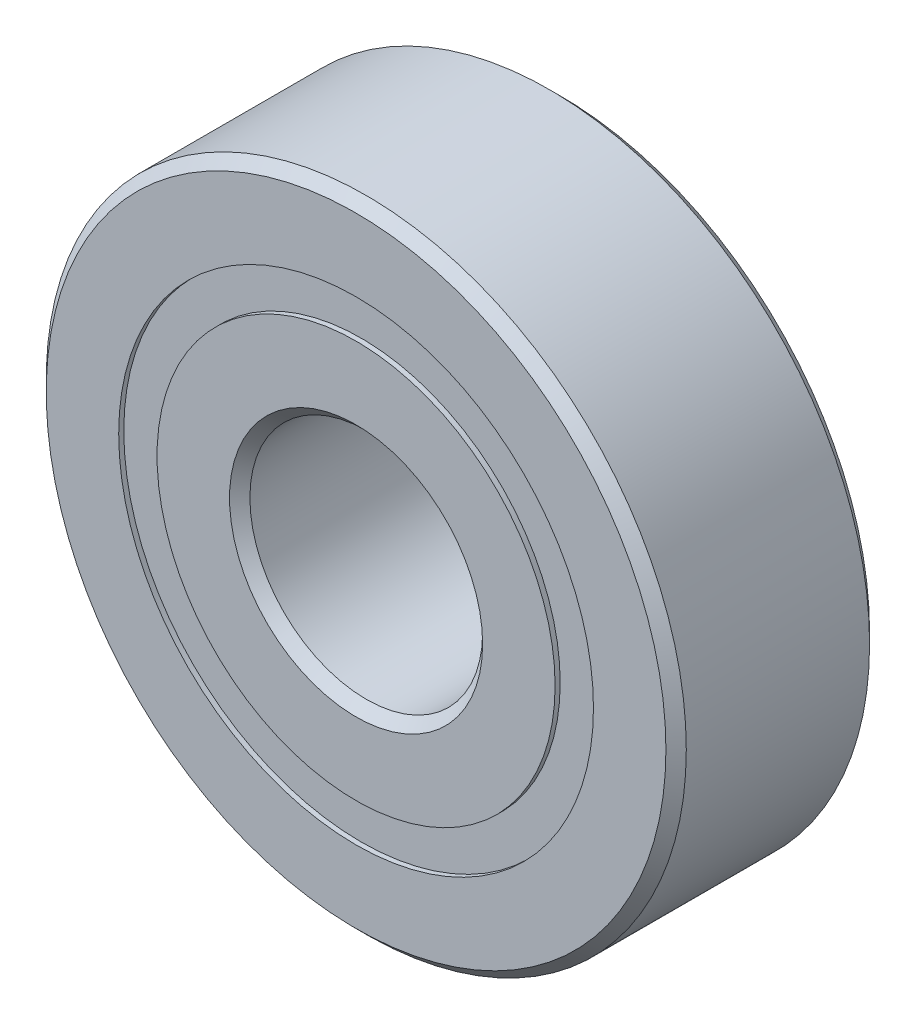
ISO-10303-21;
HEADER;
FILE_DESCRIPTION(('STEP AP214'),'2;1');
FILE_NAME('part.step','',(''),(''),'','','');
FILE_SCHEMA(('AUTOMOTIVE_DESIGN { 1 0 10303 214 1 1 1 1 }'));
ENDSEC;
DATA;
#1=APPLICATION_CONTEXT('core data for automotive mechanical design processes');
#2=APPLICATION_PROTOCOL_DEFINITION('international standard','automotive_design',2000,#1);
#3=PRODUCT_CONTEXT('',#1,'mechanical');
#4=PRODUCT('Part','Part','',(#3));
#5=PRODUCT_RELATED_PRODUCT_CATEGORY('part','',(#4));
#6=PRODUCT_DEFINITION_FORMATION('','',#4);
#7=PRODUCT_DEFINITION_CONTEXT('part definition',#1,'design');
#8=PRODUCT_DEFINITION('design','',#6,#7);
#9=PRODUCT_DEFINITION_SHAPE('','',#8);
#10=(LENGTH_UNIT() NAMED_UNIT(*) SI_UNIT(.MILLI.,.METRE.));
#11=(NAMED_UNIT(*) PLANE_ANGLE_UNIT() SI_UNIT($,.RADIAN.));
#12=(NAMED_UNIT(*) SI_UNIT($,.STERADIAN.) SOLID_ANGLE_UNIT());
#13=UNCERTAINTY_MEASURE_WITH_UNIT(LENGTH_MEASURE(1.E-05),#10,'distance_accuracy_value','');
#14=(GEOMETRIC_REPRESENTATION_CONTEXT(3) GLOBAL_UNCERTAINTY_ASSIGNED_CONTEXT((#13)) GLOBAL_UNIT_ASSIGNED_CONTEXT((#10,
#11,#12)) REPRESENTATION_CONTEXT('',''));
#15=CARTESIAN_POINT('',(0.,0.,0.));
#16=DIRECTION('',(0.,0.,1.));
#17=DIRECTION('',(1.,0.,0.));
#18=AXIS2_PLACEMENT_3D('',#15,#16,#17);
#19=CARTESIAN_POINT('',(0.,8.15934065934066,-3.325));
#20=DIRECTION('',(0.,0.,1.));
#21=DIRECTION('',(1.,0.,0.));
#22=AXIS2_PLACEMENT_3D('',#19,#20,#21);
#23=PLANE('',#22);
#24=CARTESIAN_POINT('',(0.,0.,-3.325));
#25=DIRECTION('',(0.,0.,1.));
#26=DIRECTION('',(1.,0.,0.));
#27=AXIS2_PLACEMENT_3D('',#24,#25,#26);
#28=CIRCLE('',#27,8.15934065934066);
#29=CARTESIAN_POINT('',(8.15934065934066,0.,-3.325));
#30=VERTEX_POINT('',#29);
#31=EDGE_CURVE('E53',#30,#30,#28,.T.);
#32=ORIENTED_EDGE('',*,*,#31,.F.);
#33=EDGE_LOOP('',(#32));
#34=FACE_BOUND('',#33,.T.);
#35=CARTESIAN_POINT('',(0.,0.,-3.325));
#36=DIRECTION('',(0.,0.,1.));
#37=DIRECTION('',(1.,0.,0.));
#38=AXIS2_PLACEMENT_3D('',#35,#36,#37);
#39=CIRCLE('',#38,6.84065934065934);
#40=CARTESIAN_POINT('',(6.84065934065934,0.,-3.325));
#41=VERTEX_POINT('',#40);
#42=EDGE_CURVE('E11',#41,#41,#39,.T.);
#43=ORIENTED_EDGE('',*,*,#42,.T.);
#44=EDGE_LOOP('',(#43));
#45=FACE_BOUND('',#44,.T.);
#46=ADVANCED_FACE('F39',(#34,#45),#23,.F.);
#47=CARTESIAN_POINT('',(0.,0.,3.5));
#48=DIRECTION('',(0.,0.,1.));
#49=DIRECTION('',(1.,0.,0.));
#50=AXIS2_PLACEMENT_3D('',#47,#48,#49);
#51=CYLINDRICAL_SURFACE('',#50,6.84065934065934);
#52=ORIENTED_EDGE('',*,*,#42,.F.);
#53=EDGE_LOOP('',(#52));
#54=FACE_BOUND('',#53,.T.);
#55=CARTESIAN_POINT('',(0.,0.,-1.68952158656808));
#56=DIRECTION('',(0.,0.,1.));
#57=DIRECTION('',(1.,0.,0.));
#58=AXIS2_PLACEMENT_3D('',#55,#56,#57);
#59=CIRCLE('',#58,6.84065934065934);
#60=CARTESIAN_POINT('',(6.84065934065934,0.,-1.68952158656808));
#61=VERTEX_POINT('',#60);
#62=EDGE_CURVE('E45',#61,#61,#59,.T.);
#63=ORIENTED_EDGE('',*,*,#62,.T.);
#64=EDGE_LOOP('',(#63));
#65=FACE_BOUND('',#64,.T.);
#66=ADVANCED_FACE('F62',(#54,#65),#51,.F.);
#67=CARTESIAN_POINT('',(0.,8.15934065934066,-1.68952158656808));
#68=DIRECTION('',(0.,0.,-1.));
#69=DIRECTION('',(-1.,0.,0.));
#70=AXIS2_PLACEMENT_3D('',#67,#68,#69);
#71=PLANE('',#70);
#72=ORIENTED_EDGE('',*,*,#62,.F.);
#73=EDGE_LOOP('',(#72));
#74=FACE_BOUND('',#73,.T.);
#75=CARTESIAN_POINT('',(0.,0.,-1.68952158656808));
#76=DIRECTION('',(0.,0.,1.));
#77=DIRECTION('',(1.,0.,0.));
#78=AXIS2_PLACEMENT_3D('',#75,#76,#77);
#79=CIRCLE('',#78,8.15934065934066);
#80=CARTESIAN_POINT('',(8.15934065934066,0.,-1.68952158656808));
#81=VERTEX_POINT('',#80);
#82=EDGE_CURVE('E49',#81,#81,#79,.T.);
#83=ORIENTED_EDGE('',*,*,#82,.T.);
#84=EDGE_LOOP('',(#83));
#85=FACE_BOUND('',#84,.T.);
#86=ADVANCED_FACE('F66',(#74,#85),#71,.F.);
#87=CARTESIAN_POINT('',(0.,0.,3.5));
#88=DIRECTION('',(0.,0.,1.));
#89=DIRECTION('',(1.,0.,0.));
#90=AXIS2_PLACEMENT_3D('',#87,#88,#89);
#91=CYLINDRICAL_SURFACE('',#90,8.15934065934066);
#92=ORIENTED_EDGE('',*,*,#82,.F.);
#93=EDGE_LOOP('',(#92));
#94=FACE_BOUND('',#93,.T.);
#95=ORIENTED_EDGE('',*,*,#31,.T.);
#96=EDGE_LOOP('',(#95));
#97=FACE_BOUND('',#96,.T.);
#98=ADVANCED_FACE('F59',(#94,#97),#91,.T.);
#99=CLOSED_SHELL('',(#46,#66,#86,#98));
#100=MANIFOLD_SOLID_BREP('B2',#99);
#101=CARTESIAN_POINT('',(0.,8.15934065934066,3.325));
#102=DIRECTION('',(0.,0.,-1.));
#103=DIRECTION('',(-1.,0.,0.));
#104=AXIS2_PLACEMENT_3D('',#101,#102,#103);
#105=PLANE('',#104);
#106=CARTESIAN_POINT('',(0.,0.,3.325));
#107=DIRECTION('',(0.,0.,1.));
#108=DIRECTION('',(1.,0.,0.));
#109=AXIS2_PLACEMENT_3D('',#106,#107,#108);
#110=CIRCLE('',#109,6.84065934065934);
#111=CARTESIAN_POINT('',(6.84065934065934,0.,3.325));
#112=VERTEX_POINT('',#111);
#113=EDGE_CURVE('E38',#112,#112,#110,.T.);
#114=ORIENTED_EDGE('',*,*,#113,.F.);
#115=EDGE_LOOP('',(#114));
#116=FACE_BOUND('',#115,.T.);
#117=CARTESIAN_POINT('',(0.,0.,3.325));
#118=DIRECTION('',(0.,0.,1.));
#119=DIRECTION('',(1.,0.,0.));
#120=AXIS2_PLACEMENT_3D('',#117,#118,#119);
#121=CIRCLE('',#120,8.15934065934066);
#122=CARTESIAN_POINT('',(8.15934065934066,0.,3.325));
#123=VERTEX_POINT('',#122);
#124=EDGE_CURVE('E120',#123,#123,#121,.T.);
#125=ORIENTED_EDGE('',*,*,#124,.T.);
#126=EDGE_LOOP('',(#125));
#127=FACE_BOUND('',#126,.T.);
#128=ADVANCED_FACE('F106',(#116,#127),#105,.F.);
#129=CARTESIAN_POINT('',(0.,0.,3.5));
#130=DIRECTION('',(0.,0.,1.));
#131=DIRECTION('',(1.,0.,0.));
#132=AXIS2_PLACEMENT_3D('',#129,#130,#131);
#133=CYLINDRICAL_SURFACE('',#132,6.84065934065934);
#134=CARTESIAN_POINT('',(0.,0.,1.68952158656808));
#135=DIRECTION('',(0.,0.,1.));
#136=DIRECTION('',(1.,0.,0.));
#137=AXIS2_PLACEMENT_3D('',#134,#135,#136);
#138=CIRCLE('',#137,6.84065934065934);
#139=CARTESIAN_POINT('',(6.84065934065934,0.,1.68952158656808));
#140=VERTEX_POINT('',#139);
#141=EDGE_CURVE('E112',#140,#140,#138,.T.);
#142=ORIENTED_EDGE('',*,*,#141,.F.);
#143=EDGE_LOOP('',(#142));
#144=FACE_BOUND('',#143,.T.);
#145=ORIENTED_EDGE('',*,*,#113,.T.);
#146=EDGE_LOOP('',(#145));
#147=FACE_BOUND('',#146,.T.);
#148=ADVANCED_FACE('F135',(#144,#147),#133,.F.);
#149=CARTESIAN_POINT('',(0.,8.15934065934066,1.68952158656808));
#150=DIRECTION('',(0.,0.,1.));
#151=DIRECTION('',(1.,0.,0.));
#152=AXIS2_PLACEMENT_3D('',#149,#150,#151);
#153=PLANE('',#152);
#154=CARTESIAN_POINT('',(0.,0.,1.68952158656808));
#155=DIRECTION('',(0.,0.,1.));
#156=DIRECTION('',(1.,0.,0.));
#157=AXIS2_PLACEMENT_3D('',#154,#155,#156);
#158=CIRCLE('',#157,8.15934065934066);
#159=CARTESIAN_POINT('',(8.15934065934066,0.,1.68952158656808));
#160=VERTEX_POINT('',#159);
#161=EDGE_CURVE('E116',#160,#160,#158,.T.);
#162=ORIENTED_EDGE('',*,*,#161,.F.);
#163=EDGE_LOOP('',(#162));
#164=FACE_BOUND('',#163,.T.);
#165=ORIENTED_EDGE('',*,*,#141,.T.);
#166=EDGE_LOOP('',(#165));
#167=FACE_BOUND('',#166,.T.);
#168=ADVANCED_FACE('F130',(#164,#167),#153,.F.);
#169=CARTESIAN_POINT('',(0.,0.,3.5));
#170=DIRECTION('',(0.,0.,1.));
#171=DIRECTION('',(1.,0.,0.));
#172=AXIS2_PLACEMENT_3D('',#169,#170,#171);
#173=CYLINDRICAL_SURFACE('',#172,8.15934065934066);
#174=ORIENTED_EDGE('',*,*,#124,.F.);
#175=EDGE_LOOP('',(#174));
#176=FACE_BOUND('',#175,.T.);
#177=ORIENTED_EDGE('',*,*,#161,.T.);
#178=EDGE_LOOP('',(#177));
#179=FACE_BOUND('',#178,.T.);
#180=ADVANCED_FACE('F127',(#176,#179),#173,.T.);
#181=CLOSED_SHELL('',(#128,#148,#168,#180));
#182=MANIFOLD_SOLID_BREP('B6',#181);
#183=CARTESIAN_POINT('',(-3.74999999999992,6.49519052838334,0.));
#184=DIRECTION('',(0.,0.,1.));
#185=DIRECTION('',(-0.499999999999989,0.866025403784445,0.));
#186=AXIS2_PLACEMENT_3D('',#183,#184,#185);
#187=SPHERICAL_SURFACE('',#186,1.68952158656808);
#188=CARTESIAN_POINT('',(-3.74999999999992,6.49519052838334,1.68952158656808));
#189=VERTEX_POINT('',#188);
#190=VERTEX_LOOP('',#189);
#191=FACE_BOUND('',#190,.T.);
#192=ADVANCED_FACE('F173',(#191),#187,.T.);
#193=CLOSED_SHELL('',(#192));
#194=MANIFOLD_SOLID_BREP('B33',#193);
#195=CARTESIAN_POINT('',(-6.49519052838325,3.75000000000008,0.));
#196=DIRECTION('',(0.,0.,1.));
#197=DIRECTION('',(-0.866025403784433,0.50000000000001,0.));
#198=AXIS2_PLACEMENT_3D('',#195,#196,#197);
#199=SPHERICAL_SURFACE('',#198,1.68952158656808);
#200=CARTESIAN_POINT('',(-6.49519052838325,3.75000000000008,1.68952158656808));
#201=VERTEX_POINT('',#200);
#202=VERTEX_LOOP('',#201);
#203=FACE_BOUND('',#202,.T.);
#204=ADVANCED_FACE('F193',(#203),#199,.T.);
#205=CLOSED_SHELL('',(#204));
#206=MANIFOLD_SOLID_BREP('B102',#205);
#207=CARTESIAN_POINT('',(-7.5,0.,0.));
#208=DIRECTION('',(0.,0.,1.));
#209=DIRECTION('',(-1.,0.,0.));
#210=AXIS2_PLACEMENT_3D('',#207,#208,#209);
#211=SPHERICAL_SURFACE('',#210,1.68952158656808);
#212=CARTESIAN_POINT('',(-7.5,0.,1.68952158656808));
#213=VERTEX_POINT('',#212);
#214=VERTEX_LOOP('',#213);
#215=FACE_BOUND('',#214,.T.);
#216=ADVANCED_FACE('F213',(#215),#211,.T.);
#217=CLOSED_SHELL('',(#216));
#218=MANIFOLD_SOLID_BREP('B169',#217);
#219=CARTESIAN_POINT('',(-6.49519052838332,-3.74999999999994,0.));
#220=DIRECTION('',(0.,0.,1.));
#221=DIRECTION('',(-0.866025403784443,-0.499999999999992,0.));
#222=AXIS2_PLACEMENT_3D('',#219,#220,#221);
#223=SPHERICAL_SURFACE('',#222,1.68952158656808);
#224=CARTESIAN_POINT('',(-6.49519052838332,-3.74999999999994,1.68952158656808));
#225=VERTEX_POINT('',#224);
#226=VERTEX_LOOP('',#225);
#227=FACE_BOUND('',#226,.T.);
#228=ADVANCED_FACE('F233',(#227),#223,.T.);
#229=CLOSED_SHELL('',(#228));
#230=MANIFOLD_SOLID_BREP('B189',#229);
#231=CARTESIAN_POINT('',(-3.75000000000005,-6.49519052838326,0.));
#232=DIRECTION('',(0.,0.,1.));
#233=DIRECTION('',(-0.500000000000007,-0.866025403784435,0.));
#234=AXIS2_PLACEMENT_3D('',#231,#232,#233);
#235=SPHERICAL_SURFACE('',#234,1.68952158656808);
#236=CARTESIAN_POINT('',(-3.75000000000005,-6.49519052838326,1.68952158656808));
#237=VERTEX_POINT('',#236);
#238=VERTEX_LOOP('',#237);
#239=FACE_BOUND('',#238,.T.);
#240=ADVANCED_FACE('F253',(#239),#235,.T.);
#241=CLOSED_SHELL('',(#240));
#242=MANIFOLD_SOLID_BREP('B209',#241);
#243=CARTESIAN_POINT('',(0.,-7.5,0.));
#244=DIRECTION('',(0.,0.,1.));
#245=DIRECTION('',(0.,-1.,0.));
#246=AXIS2_PLACEMENT_3D('',#243,#244,#245);
#247=SPHERICAL_SURFACE('',#246,1.68952158656808);
#248=CARTESIAN_POINT('',(0.,-7.5,1.68952158656808));
#249=VERTEX_POINT('',#248);
#250=VERTEX_LOOP('',#249);
#251=FACE_BOUND('',#250,.T.);
#252=ADVANCED_FACE('F273',(#251),#247,.T.);
#253=CLOSED_SHELL('',(#252));
#254=MANIFOLD_SOLID_BREP('B229',#253);
#255=CARTESIAN_POINT('',(3.74999999999996,-6.49519052838331,0.));
#256=DIRECTION('',(0.,0.,1.));
#257=DIRECTION('',(0.499999999999995,-0.866025403784442,0.));
#258=AXIS2_PLACEMENT_3D('',#255,#256,#257);
#259=SPHERICAL_SURFACE('',#258,1.68952158656808);
#260=CARTESIAN_POINT('',(3.74999999999996,-6.49519052838331,1.68952158656808));
#261=VERTEX_POINT('',#260);
#262=VERTEX_LOOP('',#261);
#263=FACE_BOUND('',#262,.T.);
#264=ADVANCED_FACE('F293',(#263),#259,.T.);
#265=CLOSED_SHELL('',(#264));
#266=MANIFOLD_SOLID_BREP('B249',#265);
#267=CARTESIAN_POINT('',(6.49519052838327,-3.75000000000003,0.));
#268=DIRECTION('',(0.,0.,1.));
#269=DIRECTION('',(0.866025403784436,-0.500000000000004,0.));
#270=AXIS2_PLACEMENT_3D('',#267,#268,#269);
#271=SPHERICAL_SURFACE('',#270,1.68952158656808);
#272=CARTESIAN_POINT('',(6.49519052838327,-3.75000000000003,1.68952158656808));
#273=VERTEX_POINT('',#272);
#274=VERTEX_LOOP('',#273);
#275=FACE_BOUND('',#274,.T.);
#276=ADVANCED_FACE('F313',(#275),#271,.T.);
#277=CLOSED_SHELL('',(#276));
#278=MANIFOLD_SOLID_BREP('B269',#277);
#279=CARTESIAN_POINT('',(7.5,0.,0.));
#280=DIRECTION('',(0.,0.,1.));
#281=DIRECTION('',(1.,0.,0.));
#282=AXIS2_PLACEMENT_3D('',#279,#280,#281);
#283=SPHERICAL_SURFACE('',#282,1.68952158656808);
#284=CARTESIAN_POINT('',(7.5,0.,1.68952158656808));
#285=VERTEX_POINT('',#284);
#286=VERTEX_LOOP('',#285);
#287=FACE_BOUND('',#286,.T.);
#288=ADVANCED_FACE('F333',(#287),#283,.T.);
#289=CLOSED_SHELL('',(#288));
#290=MANIFOLD_SOLID_BREP('B289',#289);
#291=CARTESIAN_POINT('',(6.4951905283833,3.74999999999998,0.));
#292=DIRECTION('',(0.,0.,1.));
#293=DIRECTION('',(0.86602540378444,0.499999999999998,0.));
#294=AXIS2_PLACEMENT_3D('',#291,#292,#293);
#295=SPHERICAL_SURFACE('',#294,1.68952158656808);
#296=CARTESIAN_POINT('',(6.4951905283833,3.74999999999998,1.68952158656808));
#297=VERTEX_POINT('',#296);
#298=VERTEX_LOOP('',#297);
#299=FACE_BOUND('',#298,.T.);
#300=ADVANCED_FACE('F353',(#299),#295,.T.);
#301=CLOSED_SHELL('',(#300));
#302=MANIFOLD_SOLID_BREP('B309',#301);
#303=CARTESIAN_POINT('',(3.75000000000001,6.49519052838328,0.));
#304=DIRECTION('',(0.,0.,1.));
#305=DIRECTION('',(0.500000000000001,0.866025403784438,0.));
#306=AXIS2_PLACEMENT_3D('',#303,#304,#305);
#307=SPHERICAL_SURFACE('',#306,1.68952158656808);
#308=CARTESIAN_POINT('',(3.75000000000001,6.49519052838328,1.68952158656808));
#309=VERTEX_POINT('',#308);
#310=VERTEX_LOOP('',#309);
#311=FACE_BOUND('',#310,.T.);
#312=ADVANCED_FACE('F373',(#311),#307,.T.);
#313=CLOSED_SHELL('',(#312));
#314=MANIFOLD_SOLID_BREP('B329',#313);
#315=CARTESIAN_POINT('',(0.,7.5,0.));
#316=DIRECTION('',(0.,0.,1.));
#317=DIRECTION('',(0.,1.,0.));
#318=AXIS2_PLACEMENT_3D('',#315,#316,#317);
#319=SPHERICAL_SURFACE('',#318,1.68952158656808);
#320=CARTESIAN_POINT('',(0.,7.5,1.68952158656808));
#321=VERTEX_POINT('',#320);
#322=VERTEX_LOOP('',#321);
#323=FACE_BOUND('',#322,.T.);
#324=ADVANCED_FACE('F395',(#323),#319,.T.);
#325=CLOSED_SHELL('',(#324));
#326=MANIFOLD_SOLID_BREP('B349',#325);
#327=CARTESIAN_POINT('',(0.,6.84065934065934,3.5));
#328=DIRECTION('',(0.,0.,-1.));
#329=DIRECTION('',(-1.,0.,0.));
#330=AXIS2_PLACEMENT_3D('',#327,#328,#329);
#331=PLANE('',#330);
#332=CARTESIAN_POINT('',(0.,0.,3.5));
#333=DIRECTION('',(0.,0.,1.));
#334=DIRECTION('',(1.,0.,0.));
#335=AXIS2_PLACEMENT_3D('',#332,#333,#334);
#336=CIRCLE('',#335,4.35);
#337=CARTESIAN_POINT('',(4.35,0.,3.5));
#338=VERTEX_POINT('',#337);
#339=EDGE_CURVE('E442',#338,#338,#336,.T.);
#340=ORIENTED_EDGE('',*,*,#339,.F.);
#341=EDGE_LOOP('',(#340));
#342=FACE_BOUND('',#341,.T.);
#343=CARTESIAN_POINT('',(0.,0.,3.5));
#344=DIRECTION('',(0.,0.,1.));
#345=DIRECTION('',(1.,0.,0.));
#346=AXIS2_PLACEMENT_3D('',#343,#344,#345);
#347=CIRCLE('',#346,6.84065934065934);
#348=CARTESIAN_POINT('',(6.84065934065934,0.,3.5));
#349=VERTEX_POINT('',#348);
#350=EDGE_CURVE('E394',#349,#349,#347,.T.);
#351=ORIENTED_EDGE('',*,*,#350,.T.);
#352=EDGE_LOOP('',(#351));
#353=FACE_BOUND('',#352,.T.);
#354=ADVANCED_FACE('F414',(#342,#353),#331,.F.);
#355=CARTESIAN_POINT('',(0.,0.,3.5));
#356=DIRECTION('',(0.,0.,1.));
#357=DIRECTION('',(1.,0.,0.));
#358=AXIS2_PLACEMENT_3D('',#355,#356,#357);
#359=CYLINDRICAL_SURFACE('',#358,6.84065934065934);
#360=ORIENTED_EDGE('',*,*,#350,.F.);
#361=EDGE_LOOP('',(#360));
#362=FACE_BOUND('',#361,.T.);
#363=CARTESIAN_POINT('',(0.,0.,1.55555555555556));
#364=DIRECTION('',(0.,0.,1.));
#365=DIRECTION('',(1.,0.,0.));
#366=AXIS2_PLACEMENT_3D('',#363,#364,#365);
#367=CIRCLE('',#366,6.84065934065934);
#368=CARTESIAN_POINT('',(6.84065934065934,0.,1.55555555555556));
#369=VERTEX_POINT('',#368);
#370=EDGE_CURVE('E420',#369,#369,#367,.T.);
#371=ORIENTED_EDGE('',*,*,#370,.T.);
#372=EDGE_LOOP('',(#371));
#373=FACE_BOUND('',#372,.T.);
#374=ADVANCED_FACE('F449',(#362,#373),#359,.T.);
#375=CARTESIAN_POINT('',(0.,0.,0.));
#376=DIRECTION('',(0.,0.,1.));
#377=DIRECTION('',(1.,0.,0.));
#378=AXIS2_PLACEMENT_3D('',#375,#376,#377);
#379=TOROIDAL_SURFACE('',#378,7.5,1.68952158656808);
#380=ORIENTED_EDGE('',*,*,#370,.F.);
#381=EDGE_LOOP('',(#380));
#382=FACE_BOUND('',#381,.T.);
#383=CARTESIAN_POINT('',(0.,0.,-1.55555555555556));
#384=DIRECTION('',(0.,0.,1.));
#385=DIRECTION('',(1.,0.,0.));
#386=AXIS2_PLACEMENT_3D('',#383,#384,#385);
#387=CIRCLE('',#386,6.84065934065934);
#388=CARTESIAN_POINT('',(6.84065934065934,0.,-1.55555555555556));
#389=VERTEX_POINT('',#388);
#390=EDGE_CURVE('E424',#389,#389,#387,.T.);
#391=ORIENTED_EDGE('',*,*,#390,.T.);
#392=EDGE_LOOP('',(#391));
#393=FACE_BOUND('',#392,.T.);
#394=ADVANCED_FACE('F453',(#382,#393),#379,.F.);
#395=CARTESIAN_POINT('',(0.,0.,3.5));
#396=DIRECTION('',(0.,0.,1.));
#397=DIRECTION('',(1.,0.,0.));
#398=AXIS2_PLACEMENT_3D('',#395,#396,#397);
#399=CYLINDRICAL_SURFACE('',#398,6.84065934065934);
#400=ORIENTED_EDGE('',*,*,#390,.F.);
#401=EDGE_LOOP('',(#400));
#402=FACE_BOUND('',#401,.T.);
#403=CARTESIAN_POINT('',(0.,0.,-3.5));
#404=DIRECTION('',(0.,0.,1.));
#405=DIRECTION('',(1.,0.,0.));
#406=AXIS2_PLACEMENT_3D('',#403,#404,#405);
#407=CIRCLE('',#406,6.84065934065934);
#408=CARTESIAN_POINT('',(6.84065934065934,0.,-3.5));
#409=VERTEX_POINT('',#408);
#410=EDGE_CURVE('E428',#409,#409,#407,.T.);
#411=ORIENTED_EDGE('',*,*,#410,.T.);
#412=EDGE_LOOP('',(#411));
#413=FACE_BOUND('',#412,.T.);
#414=ADVANCED_FACE('F458',(#402,#413),#399,.T.);
#415=CARTESIAN_POINT('',(0.,4.35,-3.5));
#416=DIRECTION('',(0.,0.,1.));
#417=DIRECTION('',(1.,0.,0.));
#418=AXIS2_PLACEMENT_3D('',#415,#416,#417);
#419=PLANE('',#418);
#420=ORIENTED_EDGE('',*,*,#410,.F.);
#421=EDGE_LOOP('',(#420));
#422=FACE_BOUND('',#421,.T.);
#423=CARTESIAN_POINT('',(0.,0.,-3.5));
#424=DIRECTION('',(0.,0.,1.));
#425=DIRECTION('',(1.,0.,0.));
#426=AXIS2_PLACEMENT_3D('',#423,#424,#425);
#427=CIRCLE('',#426,4.35);
#428=CARTESIAN_POINT('',(4.35,0.,-3.5));
#429=VERTEX_POINT('',#428);
#430=EDGE_CURVE('E433',#429,#429,#427,.T.);
#431=ORIENTED_EDGE('',*,*,#430,.T.);
#432=EDGE_LOOP('',(#431));
#433=FACE_BOUND('',#432,.T.);
#434=ADVANCED_FACE('F464',(#422,#433),#419,.F.);
#435=CARTESIAN_POINT('',(0.,0.,-3.15));
#436=DIRECTION('',(0.,0.,-1.));
#437=DIRECTION('',(-1.,0.,0.));
#438=AXIS2_PLACEMENT_3D('',#435,#436,#437);
#439=CONICAL_SURFACE('',#438,4.,0.78539816339745);
#440=ORIENTED_EDGE('',*,*,#430,.F.);
#441=EDGE_LOOP('',(#440));
#442=FACE_BOUND('',#441,.T.);
#443=CARTESIAN_POINT('',(0.,0.,-3.15));
#444=DIRECTION('',(0.,0.,1.));
#445=DIRECTION('',(1.,0.,0.));
#446=AXIS2_PLACEMENT_3D('',#443,#444,#445);
#447=CIRCLE('',#446,4.);
#448=CARTESIAN_POINT('',(4.,0.,-3.15));
#449=VERTEX_POINT('',#448);
#450=EDGE_CURVE('E436',#449,#449,#447,.T.);
#451=ORIENTED_EDGE('',*,*,#450,.T.);
#452=EDGE_LOOP('',(#451));
#453=FACE_BOUND('',#452,.T.);
#454=ADVANCED_FACE('F468',(#442,#453),#439,.F.);
#455=CARTESIAN_POINT('',(0.,0.,3.5));
#456=DIRECTION('',(0.,0.,1.));
#457=DIRECTION('',(1.,0.,0.));
#458=AXIS2_PLACEMENT_3D('',#455,#456,#457);
#459=CYLINDRICAL_SURFACE('',#458,4.);
#460=ORIENTED_EDGE('',*,*,#450,.F.);
#461=EDGE_LOOP('',(#460));
#462=FACE_BOUND('',#461,.T.);
#463=CARTESIAN_POINT('',(0.,0.,3.15));
#464=DIRECTION('',(0.,0.,1.));
#465=DIRECTION('',(1.,0.,0.));
#466=AXIS2_PLACEMENT_3D('',#463,#464,#465);
#467=CIRCLE('',#466,4.);
#468=CARTESIAN_POINT('',(4.,0.,3.15));
#469=VERTEX_POINT('',#468);
#470=EDGE_CURVE('E439',#469,#469,#467,.T.);
#471=ORIENTED_EDGE('',*,*,#470,.T.);
#472=EDGE_LOOP('',(#471));
#473=FACE_BOUND('',#472,.T.);
#474=ADVANCED_FACE('F472',(#462,#473),#459,.F.);
#475=CARTESIAN_POINT('',(0.,0.,3.5));
#476=DIRECTION('',(0.,0.,1.));
#477=DIRECTION('',(1.,0.,0.));
#478=AXIS2_PLACEMENT_3D('',#475,#476,#477);
#479=CONICAL_SURFACE('',#478,4.35,0.78539816339745);
#480=ORIENTED_EDGE('',*,*,#470,.F.);
#481=EDGE_LOOP('',(#480));
#482=FACE_BOUND('',#481,.T.);
#483=ORIENTED_EDGE('',*,*,#339,.T.);
#484=EDGE_LOOP('',(#483));
#485=FACE_BOUND('',#484,.T.);
#486=ADVANCED_FACE('F446',(#482,#485),#479,.F.);
#487=CLOSED_SHELL('',(#354,#374,#394,#414,#434,#454,#474,#486));
#488=MANIFOLD_SOLID_BREP('B369',#487);
#489=CARTESIAN_POINT('',(0.,0.,3.15));
#490=DIRECTION('',(0.,0.,-1.));
#491=DIRECTION('',(-1.,0.,0.));
#492=AXIS2_PLACEMENT_3D('',#489,#490,#491);
#493=CONICAL_SURFACE('',#492,11.,0.785398163397448);
#494=CARTESIAN_POINT('',(0.,0.,3.5));
#495=DIRECTION('',(0.,0.,1.));
#496=DIRECTION('',(1.,0.,0.));
#497=AXIS2_PLACEMENT_3D('',#494,#495,#496);
#498=CIRCLE('',#497,10.65);
#499=CARTESIAN_POINT('',(10.65,0.,3.5));
#500=VERTEX_POINT('',#499);
#501=EDGE_CURVE('E563',#500,#500,#498,.T.);
#502=ORIENTED_EDGE('',*,*,#501,.F.);
#503=EDGE_LOOP('',(#502));
#504=FACE_BOUND('',#503,.T.);
#505=CARTESIAN_POINT('',(0.,0.,3.15));
#506=DIRECTION('',(0.,0.,1.));
#507=DIRECTION('',(1.,0.,0.));
#508=AXIS2_PLACEMENT_3D('',#505,#506,#507);
#509=CIRCLE('',#508,11.);
#510=CARTESIAN_POINT('',(11.,0.,3.15));
#511=VERTEX_POINT('',#510);
#512=EDGE_CURVE('E413',#511,#511,#509,.T.);
#513=ORIENTED_EDGE('',*,*,#512,.T.);
#514=EDGE_LOOP('',(#513));
#515=FACE_BOUND('',#514,.T.);
#516=ADVANCED_FACE('F535',(#504,#515),#493,.T.);
#517=CARTESIAN_POINT('',(0.,0.,3.5));
#518=DIRECTION('',(0.,0.,1.));
#519=DIRECTION('',(1.,0.,0.));
#520=AXIS2_PLACEMENT_3D('',#517,#518,#519);
#521=CYLINDRICAL_SURFACE('',#520,11.);
#522=ORIENTED_EDGE('',*,*,#512,.F.);
#523=EDGE_LOOP('',(#522));
#524=FACE_BOUND('',#523,.T.);
#525=CARTESIAN_POINT('',(0.,0.,-3.15));
#526=DIRECTION('',(0.,0.,1.));
#527=DIRECTION('',(1.,0.,0.));
#528=AXIS2_PLACEMENT_3D('',#525,#526,#527);
#529=CIRCLE('',#528,11.);
#530=CARTESIAN_POINT('',(11.,0.,-3.15));
#531=VERTEX_POINT('',#530);
#532=EDGE_CURVE('E541',#531,#531,#529,.T.);
#533=ORIENTED_EDGE('',*,*,#532,.T.);
#534=EDGE_LOOP('',(#533));
#535=FACE_BOUND('',#534,.T.);
#536=ADVANCED_FACE('F570',(#524,#535),#521,.T.);
#537=CARTESIAN_POINT('',(0.,0.,-3.5));
#538=DIRECTION('',(0.,0.,1.));
#539=DIRECTION('',(1.,0.,0.));
#540=AXIS2_PLACEMENT_3D('',#537,#538,#539);
#541=CONICAL_SURFACE('',#540,10.65,0.785398163397448);
#542=ORIENTED_EDGE('',*,*,#532,.F.);
#543=EDGE_LOOP('',(#542));
#544=FACE_BOUND('',#543,.T.);
#545=CARTESIAN_POINT('',(0.,0.,-3.5));
#546=DIRECTION('',(0.,0.,1.));
#547=DIRECTION('',(1.,0.,0.));
#548=AXIS2_PLACEMENT_3D('',#545,#546,#547);
#549=CIRCLE('',#548,10.65);
#550=CARTESIAN_POINT('',(10.65,0.,-3.5));
#551=VERTEX_POINT('',#550);
#552=EDGE_CURVE('E545',#551,#551,#549,.T.);
#553=ORIENTED_EDGE('',*,*,#552,.T.);
#554=EDGE_LOOP('',(#553));
#555=FACE_BOUND('',#554,.T.);
#556=ADVANCED_FACE('F574',(#544,#555),#541,.T.);
#557=CARTESIAN_POINT('',(0.,10.65,-3.5));
#558=DIRECTION('',(0.,0.,1.));
#559=DIRECTION('',(1.,0.,0.));
#560=AXIS2_PLACEMENT_3D('',#557,#558,#559);
#561=PLANE('',#560);
#562=ORIENTED_EDGE('',*,*,#552,.F.);
#563=EDGE_LOOP('',(#562));
#564=FACE_BOUND('',#563,.T.);
#565=CARTESIAN_POINT('',(0.,0.,-3.5));
#566=DIRECTION('',(0.,0.,1.));
#567=DIRECTION('',(1.,0.,0.));
#568=AXIS2_PLACEMENT_3D('',#565,#566,#567);
#569=CIRCLE('',#568,8.15934065934066);
#570=CARTESIAN_POINT('',(8.15934065934066,0.,-3.5));
#571=VERTEX_POINT('',#570);
#572=EDGE_CURVE('E549',#571,#571,#569,.T.);
#573=ORIENTED_EDGE('',*,*,#572,.T.);
#574=EDGE_LOOP('',(#573));
#575=FACE_BOUND('',#574,.T.);
#576=ADVANCED_FACE('F579',(#564,#575),#561,.F.);
#577=CARTESIAN_POINT('',(0.,0.,3.5));
#578=DIRECTION('',(0.,0.,1.));
#579=DIRECTION('',(1.,0.,0.));
#580=AXIS2_PLACEMENT_3D('',#577,#578,#579);
#581=CYLINDRICAL_SURFACE('',#580,8.15934065934066);
#582=ORIENTED_EDGE('',*,*,#572,.F.);
#583=EDGE_LOOP('',(#582));
#584=FACE_BOUND('',#583,.T.);
#585=CARTESIAN_POINT('',(0.,0.,-1.55555555555556));
#586=DIRECTION('',(0.,0.,1.));
#587=DIRECTION('',(1.,0.,0.));
#588=AXIS2_PLACEMENT_3D('',#585,#586,#587);
#589=CIRCLE('',#588,8.15934065934066);
#590=CARTESIAN_POINT('',(8.15934065934066,0.,-1.55555555555556));
#591=VERTEX_POINT('',#590);
#592=EDGE_CURVE('E554',#591,#591,#589,.T.);
#593=ORIENTED_EDGE('',*,*,#592,.T.);
#594=EDGE_LOOP('',(#593));
#595=FACE_BOUND('',#594,.T.);
#596=ADVANCED_FACE('F585',(#584,#595),#581,.F.);
#597=CARTESIAN_POINT('',(0.,0.,0.));
#598=DIRECTION('',(0.,0.,1.));
#599=DIRECTION('',(1.,0.,0.));
#600=AXIS2_PLACEMENT_3D('',#597,#598,#599);
#601=TOROIDAL_SURFACE('',#600,7.5,1.68952158656808);
#602=ORIENTED_EDGE('',*,*,#592,.F.);
#603=EDGE_LOOP('',(#602));
#604=FACE_BOUND('',#603,.T.);
#605=CARTESIAN_POINT('',(0.,0.,1.55555555555556));
#606=DIRECTION('',(0.,0.,1.));
#607=DIRECTION('',(1.,0.,0.));
#608=AXIS2_PLACEMENT_3D('',#605,#606,#607);
#609=CIRCLE('',#608,8.15934065934066);
#610=CARTESIAN_POINT('',(8.15934065934066,0.,1.55555555555556));
#611=VERTEX_POINT('',#610);
#612=EDGE_CURVE('E557',#611,#611,#609,.T.);
#613=ORIENTED_EDGE('',*,*,#612,.T.);
#614=EDGE_LOOP('',(#613));
#615=FACE_BOUND('',#614,.T.);
#616=ADVANCED_FACE('F589',(#604,#615),#601,.F.);
#617=CARTESIAN_POINT('',(0.,0.,3.5));
#618=DIRECTION('',(0.,0.,1.));
#619=DIRECTION('',(1.,0.,0.));
#620=AXIS2_PLACEMENT_3D('',#617,#618,#619);
#621=CYLINDRICAL_SURFACE('',#620,8.15934065934066);
#622=ORIENTED_EDGE('',*,*,#612,.F.);
#623=EDGE_LOOP('',(#622));
#624=FACE_BOUND('',#623,.T.);
#625=CARTESIAN_POINT('',(0.,0.,3.5));
#626=DIRECTION('',(0.,0.,1.));
#627=DIRECTION('',(1.,0.,0.));
#628=AXIS2_PLACEMENT_3D('',#625,#626,#627);
#629=CIRCLE('',#628,8.15934065934066);
#630=CARTESIAN_POINT('',(8.15934065934066,0.,3.5));
#631=VERTEX_POINT('',#630);
#632=EDGE_CURVE('E560',#631,#631,#629,.T.);
#633=ORIENTED_EDGE('',*,*,#632,.T.);
#634=EDGE_LOOP('',(#633));
#635=FACE_BOUND('',#634,.T.);
#636=ADVANCED_FACE('F593',(#624,#635),#621,.F.);
#637=CARTESIAN_POINT('',(0.,10.65,3.5));
#638=DIRECTION('',(0.,0.,-1.));
#639=DIRECTION('',(-1.,0.,0.));
#640=AXIS2_PLACEMENT_3D('',#637,#638,#639);
#641=PLANE('',#640);
#642=ORIENTED_EDGE('',*,*,#632,.F.);
#643=EDGE_LOOP('',(#642));
#644=FACE_BOUND('',#643,.T.);
#645=ORIENTED_EDGE('',*,*,#501,.T.);
#646=EDGE_LOOP('',(#645));
#647=FACE_BOUND('',#646,.T.);
#648=ADVANCED_FACE('F567',(#644,#647),#641,.F.);
#649=CLOSED_SHELL('',(#516,#536,#556,#576,#596,#616,#636,#648));
#650=MANIFOLD_SOLID_BREP('B389',#649);
#651=ADVANCED_BREP_SHAPE_REPRESENTATION('',(#18,#100,#182,#194,#206,#218,#230,#242,#254,#266,
#278,#290,#302,#314,#326,#488,#650),#14);
#652=SHAPE_DEFINITION_REPRESENTATION(#9,#651);
ENDSEC;
END-ISO-10303-21;
